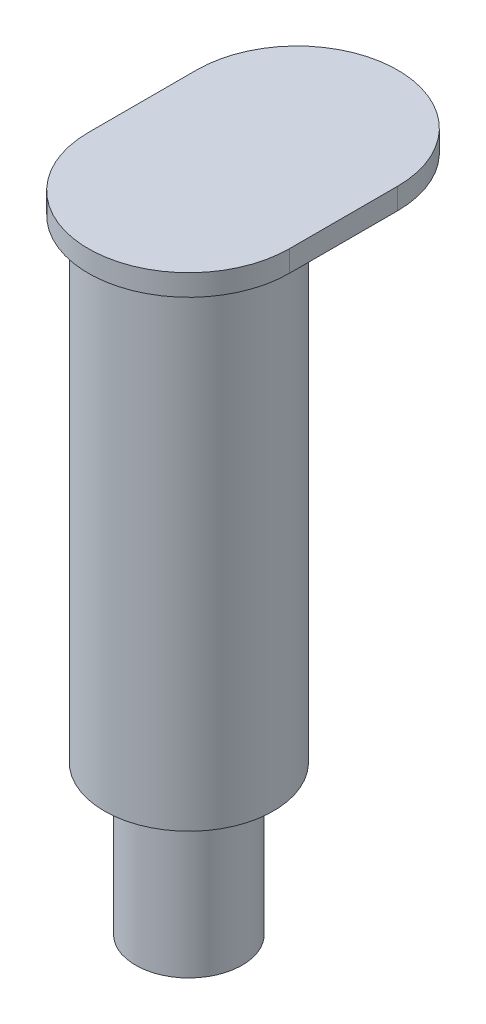
ISO-10303-21;
HEADER;
FILE_DESCRIPTION(('STEP AP214'),'2;1');
FILE_NAME('part.step','',(''),(''),'','','');
FILE_SCHEMA(('AUTOMOTIVE_DESIGN { 1 0 10303 214 1 1 1 1 }'));
ENDSEC;
DATA;
#1=APPLICATION_CONTEXT('core data for automotive mechanical design processes');
#2=APPLICATION_PROTOCOL_DEFINITION('international standard','automotive_design',2000,#1);
#3=PRODUCT_CONTEXT('',#1,'mechanical');
#4=PRODUCT('Part','Part','',(#3));
#5=PRODUCT_RELATED_PRODUCT_CATEGORY('part','',(#4));
#6=PRODUCT_DEFINITION_FORMATION('','',#4);
#7=PRODUCT_DEFINITION_CONTEXT('part definition',#1,'design');
#8=PRODUCT_DEFINITION('design','',#6,#7);
#9=PRODUCT_DEFINITION_SHAPE('','',#8);
#10=(LENGTH_UNIT() NAMED_UNIT(*) SI_UNIT(.MILLI.,.METRE.));
#11=(NAMED_UNIT(*) PLANE_ANGLE_UNIT() SI_UNIT($,.RADIAN.));
#12=(NAMED_UNIT(*) SI_UNIT($,.STERADIAN.) SOLID_ANGLE_UNIT());
#13=UNCERTAINTY_MEASURE_WITH_UNIT(LENGTH_MEASURE(1.E-05),#10,'distance_accuracy_value','');
#14=(GEOMETRIC_REPRESENTATION_CONTEXT(3) GLOBAL_UNCERTAINTY_ASSIGNED_CONTEXT((#13)) GLOBAL_UNIT_ASSIGNED_CONTEXT((#10,
#11,#12)) REPRESENTATION_CONTEXT('',''));
#15=CARTESIAN_POINT('',(0.,0.,0.));
#16=DIRECTION('',(0.,0.,1.));
#17=DIRECTION('',(1.,0.,0.));
#18=AXIS2_PLACEMENT_3D('',#15,#16,#17);
#19=CARTESIAN_POINT('',(0.,88.9,0.));
#20=DIRECTION('',(0.,-1.,0.));
#21=DIRECTION('',(0.,0.,-1.));
#22=AXIS2_PLACEMENT_3D('',#19,#20,#21);
#23=CYLINDRICAL_SURFACE('',#22,15.875);
#24=CARTESIAN_POINT('',(0.,88.9,0.));
#25=DIRECTION('',(0.,1.,0.));
#26=DIRECTION('',(0.,0.,1.));
#27=AXIS2_PLACEMENT_3D('',#24,#25,#26);
#28=CIRCLE('',#27,15.875);
#29=CARTESIAN_POINT('',(0.,88.9,15.875));
#30=VERTEX_POINT('',#29);
#31=EDGE_CURVE('E44',#30,#30,#28,.T.);
#32=ORIENTED_EDGE('',*,*,#31,.F.);
#33=EDGE_LOOP('',(#32));
#34=FACE_BOUND('',#33,.T.);
#35=CARTESIAN_POINT('',(0.,0.,0.));
#36=DIRECTION('',(0.,1.,0.));
#37=DIRECTION('',(0.,0.,1.));
#38=AXIS2_PLACEMENT_3D('',#35,#36,#37);
#39=CIRCLE('',#38,15.875);
#40=CARTESIAN_POINT('',(0.,0.,15.875));
#41=VERTEX_POINT('',#40);
#42=EDGE_CURVE('E38',#41,#41,#39,.T.);
#43=ORIENTED_EDGE('',*,*,#42,.T.);
#44=EDGE_LOOP('',(#43));
#45=FACE_BOUND('',#44,.T.);
#46=ADVANCED_FACE('F35',(#34,#45),#23,.T.);
#47=CARTESIAN_POINT('',(0.,0.,0.));
#48=DIRECTION('',(0.,1.,0.));
#49=DIRECTION('',(0.,0.,1.));
#50=AXIS2_PLACEMENT_3D('',#47,#48,#49);
#51=PLANE('',#50);
#52=CARTESIAN_POINT('',(0.,0.,0.));
#53=DIRECTION('',(0.,-1.,0.));
#54=DIRECTION('',(0.,0.,-1.));
#55=AXIS2_PLACEMENT_3D('',#52,#53,#54);
#56=CIRCLE('',#55,9.999999939);
#57=CARTESIAN_POINT('',(0.,0.,-9.999999939));
#58=VERTEX_POINT('',#57);
#59=EDGE_CURVE('E11',#58,#58,#56,.T.);
#60=ORIENTED_EDGE('',*,*,#59,.F.);
#61=EDGE_LOOP('',(#60));
#62=FACE_BOUND('',#61,.T.);
#63=ORIENTED_EDGE('',*,*,#42,.F.);
#64=EDGE_LOOP('',(#63));
#65=FACE_BOUND('',#64,.T.);
#66=ADVANCED_FACE('F120',(#62,#65),#51,.F.);
#67=CARTESIAN_POINT('',(0.,92.9,0.));
#68=DIRECTION('',(0.,-1.,0.));
#69=DIRECTION('',(0.,0.,-1.));
#70=AXIS2_PLACEMENT_3D('',#67,#68,#69);
#71=CYLINDRICAL_SURFACE('',#70,18.875);
#72=CARTESIAN_POINT('',(0.,88.9,0.));
#73=DIRECTION('',(0.,1.,0.));
#74=DIRECTION('',(0.,0.,1.));
#75=AXIS2_PLACEMENT_3D('',#72,#73,#74);
#76=CIRCLE('',#75,18.875);
#77=CARTESIAN_POINT('',(-18.875,88.9,0.));
#78=VERTEX_POINT('',#77);
#79=CARTESIAN_POINT('',(18.875,88.9,0.));
#80=VERTEX_POINT('',#79);
#81=EDGE_CURVE('E104',#78,#80,#76,.T.);
#82=ORIENTED_EDGE('',*,*,#81,.T.);
#83=DIRECTION('',(0.,-1.,0.));
#84=VECTOR('',#83,1.);
#85=CARTESIAN_POINT('',(18.875,92.9,0.));
#86=LINE('',#85,#84);
#87=CARTESIAN_POINT('',(18.875,92.9,0.));
#88=VERTEX_POINT('',#87);
#89=EDGE_CURVE('E95',#88,#80,#86,.T.);
#90=ORIENTED_EDGE('',*,*,#89,.F.);
#91=CARTESIAN_POINT('',(0.,92.9,0.));
#92=DIRECTION('',(0.,1.,0.));
#93=DIRECTION('',(0.,0.,1.));
#94=AXIS2_PLACEMENT_3D('',#91,#92,#93);
#95=CIRCLE('',#94,18.875);
#96=CARTESIAN_POINT('',(-18.875,92.9,0.));
#97=VERTEX_POINT('',#96);
#98=EDGE_CURVE('E89',#97,#88,#95,.T.);
#99=ORIENTED_EDGE('',*,*,#98,.F.);
#100=DIRECTION('',(0.,-1.,0.));
#101=VECTOR('',#100,1.);
#102=CARTESIAN_POINT('',(-18.875,92.9,0.));
#103=LINE('',#102,#101);
#104=EDGE_CURVE('E100',#97,#78,#103,.T.);
#105=ORIENTED_EDGE('',*,*,#104,.T.);
#106=EDGE_LOOP('',(#82,#90,#99,#105));
#107=FACE_BOUND('',#106,.T.);
#108=ADVANCED_FACE('F122',(#107),#71,.T.);
#109=CARTESIAN_POINT('',(18.875,92.9,0.));
#110=DIRECTION('',(-1.,0.,0.));
#111=DIRECTION('',(0.,0.,1.));
#112=AXIS2_PLACEMENT_3D('',#109,#110,#111);
#113=PLANE('',#112);
#114=DIRECTION('',(0.,0.,-1.));
#115=VECTOR('',#114,1.);
#116=CARTESIAN_POINT('',(18.875,88.9,0.));
#117=LINE('',#116,#115);
#118=CARTESIAN_POINT('',(18.875,88.9,-20.32));
#119=VERTEX_POINT('',#118);
#120=EDGE_CURVE('E94',#80,#119,#117,.T.);
#121=ORIENTED_EDGE('',*,*,#120,.T.);
#122=DIRECTION('',(0.,-1.,0.));
#123=VECTOR('',#122,1.);
#124=CARTESIAN_POINT('',(18.875,92.9,-20.32));
#125=LINE('',#124,#123);
#126=CARTESIAN_POINT('',(18.875,92.9,-20.32));
#127=VERTEX_POINT('',#126);
#128=EDGE_CURVE('E92',#127,#119,#125,.T.);
#129=ORIENTED_EDGE('',*,*,#128,.F.);
#130=DIRECTION('',(0.,0.,-1.));
#131=VECTOR('',#130,1.);
#132=CARTESIAN_POINT('',(18.875,92.9,0.));
#133=LINE('',#132,#131);
#134=EDGE_CURVE('E84',#88,#127,#133,.T.);
#135=ORIENTED_EDGE('',*,*,#134,.F.);
#136=ORIENTED_EDGE('',*,*,#89,.T.);
#137=EDGE_LOOP('',(#121,#129,#135,#136));
#138=FACE_BOUND('',#137,.T.);
#139=ADVANCED_FACE('F93',(#138),#113,.F.);
#140=CARTESIAN_POINT('',(0.,92.9,-20.32));
#141=DIRECTION('',(0.,-1.,0.));
#142=DIRECTION('',(0.,0.,-1.));
#143=AXIS2_PLACEMENT_3D('',#140,#141,#142);
#144=CYLINDRICAL_SURFACE('',#143,18.875);
#145=CARTESIAN_POINT('',(0.,88.9,-20.32));
#146=DIRECTION('',(0.,1.,0.));
#147=DIRECTION('',(0.,0.,1.));
#148=AXIS2_PLACEMENT_3D('',#145,#146,#147);
#149=CIRCLE('',#148,18.875);
#150=CARTESIAN_POINT('',(-18.875,88.9,-20.32));
#151=VERTEX_POINT('',#150);
#152=EDGE_CURVE('E70',#119,#151,#149,.T.);
#153=ORIENTED_EDGE('',*,*,#152,.T.);
#154=DIRECTION('',(0.,-1.,0.));
#155=VECTOR('',#154,1.);
#156=CARTESIAN_POINT('',(-18.875,92.9,-20.32));
#157=LINE('',#156,#155);
#158=CARTESIAN_POINT('',(-18.875,92.9,-20.32));
#159=VERTEX_POINT('',#158);
#160=EDGE_CURVE('E96',#159,#151,#157,.T.);
#161=ORIENTED_EDGE('',*,*,#160,.F.);
#162=CARTESIAN_POINT('',(0.,92.9,-20.32));
#163=DIRECTION('',(0.,1.,0.));
#164=DIRECTION('',(0.,0.,1.));
#165=AXIS2_PLACEMENT_3D('',#162,#163,#164);
#166=CIRCLE('',#165,18.875);
#167=EDGE_CURVE('E87',#127,#159,#166,.T.);
#168=ORIENTED_EDGE('',*,*,#167,.F.);
#169=ORIENTED_EDGE('',*,*,#128,.T.);
#170=EDGE_LOOP('',(#153,#161,#168,#169));
#171=FACE_BOUND('',#170,.T.);
#172=ADVANCED_FACE('F98',(#171),#144,.T.);
#173=CARTESIAN_POINT('',(-18.875,92.9,0.));
#174=DIRECTION('',(1.,0.,0.));
#175=DIRECTION('',(0.,0.,-1.));
#176=AXIS2_PLACEMENT_3D('',#173,#174,#175);
#177=PLANE('',#176);
#178=DIRECTION('',(0.,0.,1.));
#179=VECTOR('',#178,1.);
#180=CARTESIAN_POINT('',(-18.875,88.9,0.));
#181=LINE('',#180,#179);
#182=EDGE_CURVE('E76',#151,#78,#181,.T.);
#183=ORIENTED_EDGE('',*,*,#182,.T.);
#184=ORIENTED_EDGE('',*,*,#104,.F.);
#185=DIRECTION('',(0.,0.,1.));
#186=VECTOR('',#185,1.);
#187=CARTESIAN_POINT('',(-18.875,92.9,0.));
#188=LINE('',#187,#186);
#189=EDGE_CURVE('E53',#159,#97,#188,.T.);
#190=ORIENTED_EDGE('',*,*,#189,.F.);
#191=ORIENTED_EDGE('',*,*,#160,.T.);
#192=EDGE_LOOP('',(#183,#184,#190,#191));
#193=FACE_BOUND('',#192,.T.);
#194=ADVANCED_FACE('F137',(#193),#177,.F.);
#195=CARTESIAN_POINT('',(0.,92.9,0.));
#196=DIRECTION('',(0.,1.,0.));
#197=DIRECTION('',(0.,0.,1.));
#198=AXIS2_PLACEMENT_3D('',#195,#196,#197);
#199=PLANE('',#198);
#200=ORIENTED_EDGE('',*,*,#98,.T.);
#201=ORIENTED_EDGE('',*,*,#134,.T.);
#202=ORIENTED_EDGE('',*,*,#167,.T.);
#203=ORIENTED_EDGE('',*,*,#189,.T.);
#204=EDGE_LOOP('',(#200,#201,#202,#203));
#205=FACE_BOUND('',#204,.T.);
#206=ADVANCED_FACE('F85',(#205),#199,.T.);
#207=CARTESIAN_POINT('',(0.,88.9,0.));
#208=DIRECTION('',(0.,1.,0.));
#209=DIRECTION('',(0.,0.,1.));
#210=AXIS2_PLACEMENT_3D('',#207,#208,#209);
#211=PLANE('',#210);
#212=ORIENTED_EDGE('',*,*,#31,.T.);
#213=EDGE_LOOP('',(#212));
#214=FACE_BOUND('',#213,.T.);
#215=ORIENTED_EDGE('',*,*,#81,.F.);
#216=ORIENTED_EDGE('',*,*,#182,.F.);
#217=ORIENTED_EDGE('',*,*,#152,.F.);
#218=ORIENTED_EDGE('',*,*,#120,.F.);
#219=EDGE_LOOP('',(#215,#216,#217,#218));
#220=FACE_BOUND('',#219,.T.);
#221=ADVANCED_FACE('F140',(#214,#220),#211,.F.);
#222=CARTESIAN_POINT('',(0.,-27.99999991,0.));
#223=DIRECTION('',(0.,1.,0.));
#224=DIRECTION('',(0.,0.,1.));
#225=AXIS2_PLACEMENT_3D('',#222,#223,#224);
#226=CYLINDRICAL_SURFACE('',#225,9.999999939);
#227=CARTESIAN_POINT('',(0.,-27.99999991,0.));
#228=DIRECTION('',(0.,-1.,0.));
#229=DIRECTION('',(0.,0.,-1.));
#230=AXIS2_PLACEMENT_3D('',#227,#228,#229);
#231=CIRCLE('',#230,9.999999939);
#232=CARTESIAN_POINT('',(0.,-27.99999991,-9.999999939));
#233=VERTEX_POINT('',#232);
#234=EDGE_CURVE('E107',#233,#233,#231,.T.);
#235=ORIENTED_EDGE('',*,*,#234,.F.);
#236=EDGE_LOOP('',(#235));
#237=FACE_BOUND('',#236,.T.);
#238=ORIENTED_EDGE('',*,*,#59,.T.);
#239=EDGE_LOOP('',(#238));
#240=FACE_BOUND('',#239,.T.);
#241=ADVANCED_FACE('F143',(#237,#240),#226,.T.);
#242=CARTESIAN_POINT('',(0.,-27.99999991,0.));
#243=DIRECTION('',(0.,-1.,0.));
#244=DIRECTION('',(0.,0.,-1.));
#245=AXIS2_PLACEMENT_3D('',#242,#243,#244);
#246=PLANE('',#245);
#247=ORIENTED_EDGE('',*,*,#234,.T.);
#248=EDGE_LOOP('',(#247));
#249=FACE_BOUND('',#248,.T.);
#250=ADVANCED_FACE('F148',(#249),#246,.T.);
#251=CLOSED_SHELL('',(#46,#66,#108,#139,#172,#194,#206,#221,#241,#250));
#252=MANIFOLD_SOLID_BREP('B2',#251);
#253=ADVANCED_BREP_SHAPE_REPRESENTATION('',(#18,#252),#14);
#254=SHAPE_DEFINITION_REPRESENTATION(#9,#253);
ENDSEC;
END-ISO-10303-21;
